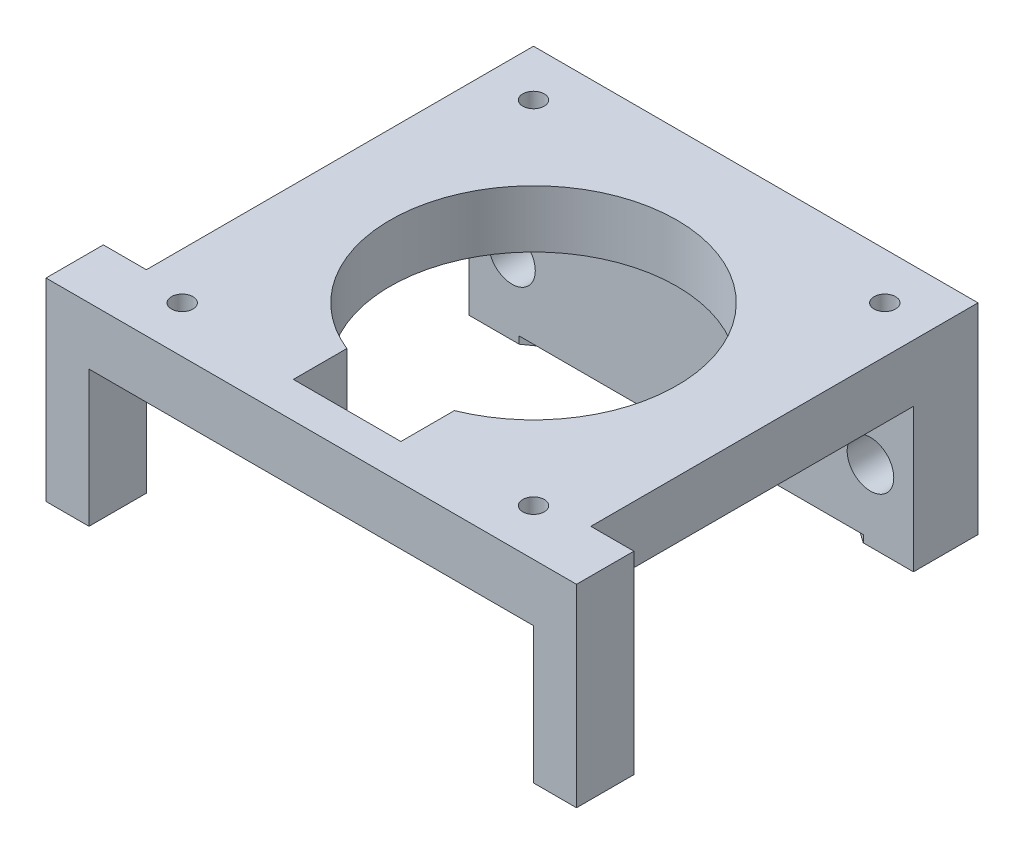
ISO-10303-21;
HEADER;
FILE_DESCRIPTION(('STEP AP214'),'2;1');
FILE_NAME('part.step','',(''),(''),'','','');
FILE_SCHEMA(('AUTOMOTIVE_DESIGN { 1 0 10303 214 1 1 1 1 }'));
ENDSEC;
DATA;
#1=APPLICATION_CONTEXT('core data for automotive mechanical design processes');
#2=APPLICATION_PROTOCOL_DEFINITION('international standard','automotive_design',2000,#1);
#3=PRODUCT_CONTEXT('',#1,'mechanical');
#4=PRODUCT('Part','Part','',(#3));
#5=PRODUCT_RELATED_PRODUCT_CATEGORY('part','',(#4));
#6=PRODUCT_DEFINITION_FORMATION('','',#4);
#7=PRODUCT_DEFINITION_CONTEXT('part definition',#1,'design');
#8=PRODUCT_DEFINITION('design','',#6,#7);
#9=PRODUCT_DEFINITION_SHAPE('','',#8);
#10=(LENGTH_UNIT() NAMED_UNIT(*) SI_UNIT(.MILLI.,.METRE.));
#11=(NAMED_UNIT(*) PLANE_ANGLE_UNIT() SI_UNIT($,.RADIAN.));
#12=(NAMED_UNIT(*) SI_UNIT($,.STERADIAN.) SOLID_ANGLE_UNIT());
#13=UNCERTAINTY_MEASURE_WITH_UNIT(LENGTH_MEASURE(1.E-05),#10,'distance_accuracy_value','');
#14=(GEOMETRIC_REPRESENTATION_CONTEXT(3) GLOBAL_UNCERTAINTY_ASSIGNED_CONTEXT((#13)) GLOBAL_UNIT_ASSIGNED_CONTEXT((#10,
#11,#12)) REPRESENTATION_CONTEXT('',''));
#15=CARTESIAN_POINT('',(0.,0.,0.));
#16=DIRECTION('',(0.,0.,1.));
#17=DIRECTION('',(1.,0.,0.));
#18=AXIS2_PLACEMENT_3D('',#15,#16,#17);
#19=CARTESIAN_POINT('',(15.5,4.,-15.5));
#20=DIRECTION('',(-1.,0.,0.));
#21=DIRECTION('',(0.,0.,1.));
#22=AXIS2_PLACEMENT_3D('',#19,#20,#21);
#23=PLANE('',#22);
#24=DIRECTION('',(0.,1.,0.));
#25=VECTOR('',#24,1.);
#26=CARTESIAN_POINT('',(15.5,-14.5,11.5));
#27=LINE('',#26,#25);
#28=CARTESIAN_POINT('',(15.5,0.,11.5));
#29=VERTEX_POINT('',#28);
#30=CARTESIAN_POINT('',(15.5,4.,11.5));
#31=VERTEX_POINT('',#30);
#32=EDGE_CURVE('E11',#29,#31,#27,.T.);
#33=ORIENTED_EDGE('',*,*,#32,.F.);
#34=DIRECTION('',(0.,0.,-1.));
#35=VECTOR('',#34,1.);
#36=CARTESIAN_POINT('',(15.5,0.,-15.5));
#37=LINE('',#36,#35);
#38=CARTESIAN_POINT('',(15.5,0.,-11.));
#39=VERTEX_POINT('',#38);
#40=EDGE_CURVE('E331',#29,#39,#37,.T.);
#41=ORIENTED_EDGE('',*,*,#40,.T.);
#42=DIRECTION('',(0.,1.,0.));
#43=VECTOR('',#42,1.);
#44=CARTESIAN_POINT('',(15.5,-10.,-11.));
#45=LINE('',#44,#43);
#46=CARTESIAN_POINT('',(15.5,-10.,-11.));
#47=VERTEX_POINT('',#46);
#48=EDGE_CURVE('E281',#47,#39,#45,.T.);
#49=ORIENTED_EDGE('',*,*,#48,.F.);
#50=DIRECTION('',(0.,0.,1.));
#51=VECTOR('',#50,1.);
#52=CARTESIAN_POINT('',(15.5,-10.,-15.5));
#53=LINE('',#52,#51);
#54=CARTESIAN_POINT('',(15.5,-10.,-15.5));
#55=VERTEX_POINT('',#54);
#56=EDGE_CURVE('E270',#55,#47,#53,.T.);
#57=ORIENTED_EDGE('',*,*,#56,.F.);
#58=DIRECTION('',(0.,-1.,0.));
#59=VECTOR('',#58,1.);
#60=CARTESIAN_POINT('',(15.5,4.,-15.5));
#61=LINE('',#60,#59);
#62=CARTESIAN_POINT('',(15.5,4.,-15.5));
#63=VERTEX_POINT('',#62);
#64=EDGE_CURVE('E335',#63,#55,#61,.T.);
#65=ORIENTED_EDGE('',*,*,#64,.F.);
#66=DIRECTION('',(0.,0.,-1.));
#67=VECTOR('',#66,1.);
#68=CARTESIAN_POINT('',(15.5,4.,-15.5));
#69=LINE('',#68,#67);
#70=EDGE_CURVE('E321',#31,#63,#69,.T.);
#71=ORIENTED_EDGE('',*,*,#70,.F.);
#72=EDGE_LOOP('',(#33,#41,#49,#57,#65,#71));
#73=FACE_BOUND('',#72,.T.);
#74=ADVANCED_FACE('F32',(#73),#23,.F.);
#75=CARTESIAN_POINT('',(0.,0.,0.));
#76=DIRECTION('',(0.,1.,0.));
#77=DIRECTION('',(0.,0.,1.));
#78=AXIS2_PLACEMENT_3D('',#75,#76,#77);
#79=PLANE('',#78);
#80=CARTESIAN_POINT('',(0.,0.,0.));
#81=DIRECTION('',(0.,1.,0.));
#82=DIRECTION('',(0.,0.,1.));
#83=AXIS2_PLACEMENT_3D('',#80,#81,#82);
#84=CIRCLE('',#83,10.);
#85=CARTESIAN_POINT('',(3.75,0.,9.27024810886958));
#86=VERTEX_POINT('',#85);
#87=CARTESIAN_POINT('',(-3.75,0.,9.27024810886958));
#88=VERTEX_POINT('',#87);
#89=EDGE_CURVE('E284',#86,#88,#84,.T.);
#90=ORIENTED_EDGE('',*,*,#89,.T.);
#91=DIRECTION('',(0.,0.,1.));
#92=VECTOR('',#91,1.);
#93=CARTESIAN_POINT('',(-3.75,0.,0.));
#94=LINE('',#93,#92);
#95=CARTESIAN_POINT('',(-3.75,0.,13.));
#96=VERTEX_POINT('',#95);
#97=EDGE_CURVE('E245',#88,#96,#94,.T.);
#98=ORIENTED_EDGE('',*,*,#97,.T.);
#99=DIRECTION('',(1.,0.,0.));
#100=VECTOR('',#99,1.);
#101=CARTESIAN_POINT('',(0.,0.,13.));
#102=LINE('',#101,#100);
#103=CARTESIAN_POINT('',(3.75,0.,13.));
#104=VERTEX_POINT('',#103);
#105=EDGE_CURVE('E248',#96,#104,#102,.T.);
#106=ORIENTED_EDGE('',*,*,#105,.T.);
#107=DIRECTION('',(0.,0.,-1.));
#108=VECTOR('',#107,1.);
#109=CARTESIAN_POINT('',(3.75,0.,0.));
#110=LINE('',#109,#108);
#111=EDGE_CURVE('E241',#104,#86,#110,.T.);
#112=ORIENTED_EDGE('',*,*,#111,.T.);
#113=EDGE_LOOP('',(#90,#98,#106,#112));
#114=FACE_BOUND('',#113,.T.);
#115=CARTESIAN_POINT('',(-12.25,0.,12.25));
#116=DIRECTION('',(0.,1.,0.));
#117=DIRECTION('',(0.,0.,1.));
#118=AXIS2_PLACEMENT_3D('',#115,#116,#117);
#119=CIRCLE('',#118,0.75);
#120=CARTESIAN_POINT('',(-12.25,0.,13.));
#121=VERTEX_POINT('',#120);
#122=EDGE_CURVE('E288',#121,#121,#119,.T.);
#123=ORIENTED_EDGE('',*,*,#122,.T.);
#124=EDGE_LOOP('',(#123));
#125=FACE_BOUND('',#124,.T.);
#126=CARTESIAN_POINT('',(12.25,0.,12.25));
#127=DIRECTION('',(0.,1.,0.));
#128=DIRECTION('',(0.,0.,1.));
#129=AXIS2_PLACEMENT_3D('',#126,#127,#128);
#130=CIRCLE('',#129,0.75);
#131=CARTESIAN_POINT('',(12.25,0.,13.));
#132=VERTEX_POINT('',#131);
#133=EDGE_CURVE('E294',#132,#132,#130,.T.);
#134=ORIENTED_EDGE('',*,*,#133,.T.);
#135=EDGE_LOOP('',(#134));
#136=FACE_BOUND('',#135,.T.);
#137=DIRECTION('',(-1.,0.,0.));
#138=VECTOR('',#137,1.);
#139=CARTESIAN_POINT('',(-15.5,0.,-11.));
#140=LINE('',#139,#138);
#141=CARTESIAN_POINT('',(-15.5,0.,-11.));
#142=VERTEX_POINT('',#141);
#143=EDGE_CURVE('E261',#39,#142,#140,.T.);
#144=ORIENTED_EDGE('',*,*,#143,.F.);
#145=ORIENTED_EDGE('',*,*,#40,.F.);
#146=CARTESIAN_POINT('',(15.5,0.,15.5));
#147=VERTEX_POINT('',#146);
#148=EDGE_CURVE('E319',#147,#29,#37,.T.);
#149=ORIENTED_EDGE('',*,*,#148,.F.);
#150=DIRECTION('',(1.,0.,0.));
#151=VECTOR('',#150,1.);
#152=CARTESIAN_POINT('',(-15.5,0.,15.5));
#153=LINE('',#152,#151);
#154=CARTESIAN_POINT('',(-15.5,0.,15.5));
#155=VERTEX_POINT('',#154);
#156=EDGE_CURVE('E329',#155,#147,#153,.T.);
#157=ORIENTED_EDGE('',*,*,#156,.F.);
#158=DIRECTION('',(0.,0.,1.));
#159=VECTOR('',#158,1.);
#160=CARTESIAN_POINT('',(-15.5,0.,-15.5));
#161=LINE('',#160,#159);
#162=CARTESIAN_POINT('',(-15.5,0.,11.5));
#163=VERTEX_POINT('',#162);
#164=EDGE_CURVE('E312',#163,#155,#161,.T.);
#165=ORIENTED_EDGE('',*,*,#164,.F.);
#166=EDGE_CURVE('E326',#142,#163,#161,.T.);
#167=ORIENTED_EDGE('',*,*,#166,.F.);
#168=EDGE_LOOP('',(#144,#145,#149,#157,#165,#167));
#169=FACE_BOUND('',#168,.T.);
#170=ADVANCED_FACE('F372',(#114,#125,#136,#169),#79,.F.);
#171=CARTESIAN_POINT('',(0.,4.,0.));
#172=DIRECTION('',(0.,1.,0.));
#173=DIRECTION('',(0.,0.,1.));
#174=AXIS2_PLACEMENT_3D('',#171,#172,#173);
#175=PLANE('',#174);
#176=DIRECTION('',(0.,0.,1.));
#177=VECTOR('',#176,1.);
#178=CARTESIAN_POINT('',(-3.75,4.,5.));
#179=LINE('',#178,#177);
#180=CARTESIAN_POINT('',(-3.75,4.,9.27024810886958));
#181=VERTEX_POINT('',#180);
#182=CARTESIAN_POINT('',(-3.75,4.,13.));
#183=VERTEX_POINT('',#182);
#184=EDGE_CURVE('E229',#181,#183,#179,.T.);
#185=ORIENTED_EDGE('',*,*,#184,.F.);
#186=CARTESIAN_POINT('',(0.,4.,0.));
#187=DIRECTION('',(0.,1.,0.));
#188=DIRECTION('',(0.,0.,1.));
#189=AXIS2_PLACEMENT_3D('',#186,#187,#188);
#190=CIRCLE('',#189,10.);
#191=CARTESIAN_POINT('',(3.75,4.,9.27024810886958));
#192=VERTEX_POINT('',#191);
#193=EDGE_CURVE('E285',#192,#181,#190,.T.);
#194=ORIENTED_EDGE('',*,*,#193,.F.);
#195=DIRECTION('',(0.,0.,-1.));
#196=VECTOR('',#195,1.);
#197=CARTESIAN_POINT('',(3.75,4.,5.));
#198=LINE('',#197,#196);
#199=CARTESIAN_POINT('',(3.75,4.,13.));
#200=VERTEX_POINT('',#199);
#201=EDGE_CURVE('E236',#200,#192,#198,.T.);
#202=ORIENTED_EDGE('',*,*,#201,.F.);
#203=DIRECTION('',(1.,0.,0.));
#204=VECTOR('',#203,1.);
#205=CARTESIAN_POINT('',(-3.75,4.,13.));
#206=LINE('',#205,#204);
#207=EDGE_CURVE('E233',#183,#200,#206,.T.);
#208=ORIENTED_EDGE('',*,*,#207,.F.);
#209=EDGE_LOOP('',(#185,#194,#202,#208));
#210=FACE_BOUND('',#209,.T.);
#211=CARTESIAN_POINT('',(-12.25,4.,12.25));
#212=DIRECTION('',(0.,1.,0.));
#213=DIRECTION('',(0.,0.,1.));
#214=AXIS2_PLACEMENT_3D('',#211,#212,#213);
#215=CIRCLE('',#214,0.75);
#216=CARTESIAN_POINT('',(-12.25,4.,13.));
#217=VERTEX_POINT('',#216);
#218=EDGE_CURVE('E291',#217,#217,#215,.T.);
#219=ORIENTED_EDGE('',*,*,#218,.F.);
#220=EDGE_LOOP('',(#219));
#221=FACE_BOUND('',#220,.T.);
#222=CARTESIAN_POINT('',(12.25,4.,-12.25));
#223=DIRECTION('',(0.,1.,0.));
#224=DIRECTION('',(0.,0.,1.));
#225=AXIS2_PLACEMENT_3D('',#222,#223,#224);
#226=CIRCLE('',#225,0.75);
#227=CARTESIAN_POINT('',(12.25,4.,-11.5));
#228=VERTEX_POINT('',#227);
#229=EDGE_CURVE('E303',#228,#228,#226,.T.);
#230=ORIENTED_EDGE('',*,*,#229,.F.);
#231=EDGE_LOOP('',(#230));
#232=FACE_BOUND('',#231,.T.);
#233=DIRECTION('',(0.,0.,1.));
#234=VECTOR('',#233,1.);
#235=CARTESIAN_POINT('',(-15.5,4.,-15.5));
#236=LINE('',#235,#234);
#237=CARTESIAN_POINT('',(-15.5,4.,-15.5));
#238=VERTEX_POINT('',#237);
#239=CARTESIAN_POINT('',(-15.5,4.,11.5));
#240=VERTEX_POINT('',#239);
#241=EDGE_CURVE('E315',#238,#240,#236,.T.);
#242=ORIENTED_EDGE('',*,*,#241,.T.);
#243=DIRECTION('',(-1.,0.,0.));
#244=VECTOR('',#243,1.);
#245=CARTESIAN_POINT('',(-15.5,4.,11.5));
#246=LINE('',#245,#244);
#247=CARTESIAN_POINT('',(-18.5,4.,11.5));
#248=VERTEX_POINT('',#247);
#249=EDGE_CURVE('E56',#240,#248,#246,.T.);
#250=ORIENTED_EDGE('',*,*,#249,.T.);
#251=DIRECTION('',(0.,0.,1.));
#252=VECTOR('',#251,1.);
#253=CARTESIAN_POINT('',(-18.5,4.,15.5));
#254=LINE('',#253,#252);
#255=CARTESIAN_POINT('',(-18.5,4.,15.5));
#256=VERTEX_POINT('',#255);
#257=EDGE_CURVE('E199',#248,#256,#254,.T.);
#258=ORIENTED_EDGE('',*,*,#257,.T.);
#259=DIRECTION('',(1.,0.,0.));
#260=VECTOR('',#259,1.);
#261=CARTESIAN_POINT('',(-15.5,4.,15.5));
#262=LINE('',#261,#260);
#263=CARTESIAN_POINT('',(18.5,4.,15.5));
#264=VERTEX_POINT('',#263);
#265=EDGE_CURVE('E318',#256,#264,#262,.T.);
#266=ORIENTED_EDGE('',*,*,#265,.T.);
#267=DIRECTION('',(0.,0.,-1.));
#268=VECTOR('',#267,1.);
#269=CARTESIAN_POINT('',(18.5,4.,15.5));
#270=LINE('',#269,#268);
#271=CARTESIAN_POINT('',(18.5,4.,11.5));
#272=VERTEX_POINT('',#271);
#273=EDGE_CURVE('E180',#264,#272,#270,.T.);
#274=ORIENTED_EDGE('',*,*,#273,.T.);
#275=DIRECTION('',(-1.,0.,0.));
#276=VECTOR('',#275,1.);
#277=CARTESIAN_POINT('',(15.5,4.,11.5));
#278=LINE('',#277,#276);
#279=EDGE_CURVE('E187',#272,#31,#278,.T.);
#280=ORIENTED_EDGE('',*,*,#279,.T.);
#281=ORIENTED_EDGE('',*,*,#70,.T.);
#282=DIRECTION('',(-1.,0.,0.));
#283=VECTOR('',#282,1.);
#284=CARTESIAN_POINT('',(-15.5,4.,-15.5));
#285=LINE('',#284,#283);
#286=EDGE_CURVE('E323',#63,#238,#285,.T.);
#287=ORIENTED_EDGE('',*,*,#286,.T.);
#288=EDGE_LOOP('',(#242,#250,#258,#266,#274,#280,#281,#287));
#289=FACE_BOUND('',#288,.T.);
#290=CARTESIAN_POINT('',(-12.25,4.,-12.25));
#291=DIRECTION('',(0.,1.,0.));
#292=DIRECTION('',(0.,0.,1.));
#293=AXIS2_PLACEMENT_3D('',#290,#291,#292);
#294=CIRCLE('',#293,0.75);
#295=CARTESIAN_POINT('',(-12.25,4.,-11.5));
#296=VERTEX_POINT('',#295);
#297=EDGE_CURVE('E309',#296,#296,#294,.T.);
#298=ORIENTED_EDGE('',*,*,#297,.F.);
#299=EDGE_LOOP('',(#298));
#300=FACE_BOUND('',#299,.T.);
#301=CARTESIAN_POINT('',(12.25,4.,12.25));
#302=DIRECTION('',(0.,1.,0.));
#303=DIRECTION('',(0.,0.,1.));
#304=AXIS2_PLACEMENT_3D('',#301,#302,#303);
#305=CIRCLE('',#304,0.75);
#306=CARTESIAN_POINT('',(12.25,4.,13.));
#307=VERTEX_POINT('',#306);
#308=EDGE_CURVE('E297',#307,#307,#305,.T.);
#309=ORIENTED_EDGE('',*,*,#308,.F.);
#310=EDGE_LOOP('',(#309));
#311=FACE_BOUND('',#310,.T.);
#312=ADVANCED_FACE('F354',(#210,#221,#232,#289,#300,#311),#175,.T.);
#313=CARTESIAN_POINT('',(-15.5,4.,-15.5));
#314=DIRECTION('',(1.,0.,0.));
#315=DIRECTION('',(0.,0.,-1.));
#316=AXIS2_PLACEMENT_3D('',#313,#314,#315);
#317=PLANE('',#316);
#318=ORIENTED_EDGE('',*,*,#166,.T.);
#319=DIRECTION('',(0.,1.,0.));
#320=VECTOR('',#319,1.);
#321=CARTESIAN_POINT('',(-15.5,-14.5,11.5));
#322=LINE('',#321,#320);
#323=EDGE_CURVE('E41',#163,#240,#322,.T.);
#324=ORIENTED_EDGE('',*,*,#323,.T.);
#325=ORIENTED_EDGE('',*,*,#241,.F.);
#326=DIRECTION('',(0.,-1.,0.));
#327=VECTOR('',#326,1.);
#328=CARTESIAN_POINT('',(-15.5,4.,-15.5));
#329=LINE('',#328,#327);
#330=CARTESIAN_POINT('',(-15.5,-10.,-15.5));
#331=VERTEX_POINT('',#330);
#332=EDGE_CURVE('E325',#238,#331,#329,.T.);
#333=ORIENTED_EDGE('',*,*,#332,.T.);
#334=DIRECTION('',(0.,0.,-1.));
#335=VECTOR('',#334,1.);
#336=CARTESIAN_POINT('',(-15.5,-10.,-15.5));
#337=LINE('',#336,#335);
#338=CARTESIAN_POINT('',(-15.5,-10.,-11.));
#339=VERTEX_POINT('',#338);
#340=EDGE_CURVE('E264',#339,#331,#337,.T.);
#341=ORIENTED_EDGE('',*,*,#340,.F.);
#342=DIRECTION('',(0.,1.,0.));
#343=VECTOR('',#342,1.);
#344=CARTESIAN_POINT('',(-15.5,-10.,-11.));
#345=LINE('',#344,#343);
#346=EDGE_CURVE('E276',#339,#142,#345,.T.);
#347=ORIENTED_EDGE('',*,*,#346,.T.);
#348=EDGE_LOOP('',(#318,#324,#325,#333,#341,#347));
#349=FACE_BOUND('',#348,.T.);
#350=ADVANCED_FACE('F34',(#349),#317,.F.);
#351=CARTESIAN_POINT('',(-15.5,4.,15.5));
#352=DIRECTION('',(0.,0.,-1.));
#353=DIRECTION('',(-1.,0.,0.));
#354=AXIS2_PLACEMENT_3D('',#351,#352,#353);
#355=PLANE('',#354);
#356=ORIENTED_EDGE('',*,*,#156,.T.);
#357=DIRECTION('',(0.,1.,0.));
#358=VECTOR('',#357,1.);
#359=CARTESIAN_POINT('',(15.5,-14.5,15.5));
#360=LINE('',#359,#358);
#361=CARTESIAN_POINT('',(15.5,-9.5,15.5));
#362=VERTEX_POINT('',#361);
#363=EDGE_CURVE('E186',#362,#147,#360,.T.);
#364=ORIENTED_EDGE('',*,*,#363,.F.);
#365=DIRECTION('',(1.,0.,0.));
#366=VECTOR('',#365,1.);
#367=CARTESIAN_POINT('',(15.5,-9.5,15.5));
#368=LINE('',#367,#366);
#369=CARTESIAN_POINT('',(18.5,-9.5,15.5));
#370=VERTEX_POINT('',#369);
#371=EDGE_CURVE('E167',#362,#370,#368,.T.);
#372=ORIENTED_EDGE('',*,*,#371,.T.);
#373=DIRECTION('',(0.,1.,0.));
#374=VECTOR('',#373,1.);
#375=CARTESIAN_POINT('',(18.5,-14.5,15.5));
#376=LINE('',#375,#374);
#377=EDGE_CURVE('E174',#370,#264,#376,.T.);
#378=ORIENTED_EDGE('',*,*,#377,.T.);
#379=ORIENTED_EDGE('',*,*,#265,.F.);
#380=DIRECTION('',(0.,1.,0.));
#381=VECTOR('',#380,1.);
#382=CARTESIAN_POINT('',(-18.5,-14.5,15.5));
#383=LINE('',#382,#381);
#384=CARTESIAN_POINT('',(-18.5,-9.5,15.5));
#385=VERTEX_POINT('',#384);
#386=EDGE_CURVE('E215',#385,#256,#383,.T.);
#387=ORIENTED_EDGE('',*,*,#386,.F.);
#388=DIRECTION('',(1.,0.,0.));
#389=VECTOR('',#388,1.);
#390=CARTESIAN_POINT('',(-15.5,-9.5,15.5));
#391=LINE('',#390,#389);
#392=CARTESIAN_POINT('',(-15.5,-9.5,15.5));
#393=VERTEX_POINT('',#392);
#394=EDGE_CURVE('E212',#385,#393,#391,.T.);
#395=ORIENTED_EDGE('',*,*,#394,.T.);
#396=DIRECTION('',(0.,1.,0.));
#397=VECTOR('',#396,1.);
#398=CARTESIAN_POINT('',(-15.5,-14.5,15.5));
#399=LINE('',#398,#397);
#400=EDGE_CURVE('E211',#393,#155,#399,.T.);
#401=ORIENTED_EDGE('',*,*,#400,.T.);
#402=EDGE_LOOP('',(#356,#364,#372,#378,#379,#387,#395,#401));
#403=FACE_BOUND('',#402,.T.);
#404=ADVANCED_FACE('F184',(#403),#355,.F.);
#405=CARTESIAN_POINT('',(-15.5,4.,-15.5));
#406=DIRECTION('',(0.,0.,1.));
#407=DIRECTION('',(1.,0.,0.));
#408=AXIS2_PLACEMENT_3D('',#405,#406,#407);
#409=PLANE('',#408);
#410=CARTESIAN_POINT('',(12.5,-5.,-15.5));
#411=DIRECTION('',(0.,0.,1.));
#412=DIRECTION('',(1.,0.,0.));
#413=AXIS2_PLACEMENT_3D('',#410,#411,#412);
#414=CIRCLE('',#413,1.625);
#415=CARTESIAN_POINT('',(14.125,-5.,-15.5));
#416=VERTEX_POINT('',#415);
#417=EDGE_CURVE('E252',#416,#416,#414,.T.);
#418=ORIENTED_EDGE('',*,*,#417,.T.);
#419=EDGE_LOOP('',(#418));
#420=FACE_BOUND('',#419,.T.);
#421=CARTESIAN_POINT('',(-12.5,-5.,-15.5));
#422=DIRECTION('',(0.,0.,1.));
#423=DIRECTION('',(1.,0.,0.));
#424=AXIS2_PLACEMENT_3D('',#421,#422,#423);
#425=CIRCLE('',#424,1.625);
#426=CARTESIAN_POINT('',(-10.875,-5.,-15.5));
#427=VERTEX_POINT('',#426);
#428=EDGE_CURVE('E258',#427,#427,#425,.T.);
#429=ORIENTED_EDGE('',*,*,#428,.T.);
#430=EDGE_LOOP('',(#429));
#431=FACE_BOUND('',#430,.T.);
#432=ORIENTED_EDGE('',*,*,#64,.T.);
#433=DIRECTION('',(1.,0.,0.));
#434=VECTOR('',#433,1.);
#435=CARTESIAN_POINT('',(-15.5,-10.,-15.5));
#436=LINE('',#435,#434);
#437=EDGE_CURVE('E267',#331,#55,#436,.T.);
#438=ORIENTED_EDGE('',*,*,#437,.F.);
#439=ORIENTED_EDGE('',*,*,#332,.F.);
#440=ORIENTED_EDGE('',*,*,#286,.F.);
#441=EDGE_LOOP('',(#432,#438,#439,#440));
#442=FACE_BOUND('',#441,.T.);
#443=ADVANCED_FACE('F361',(#420,#431,#442),#409,.F.);
#444=CARTESIAN_POINT('',(-12.25,4.,-12.25));
#445=DIRECTION('',(0.,-1.,0.));
#446=DIRECTION('',(0.,0.,-1.));
#447=AXIS2_PLACEMENT_3D('',#444,#445,#446);
#448=CYLINDRICAL_SURFACE('',#447,0.75);
#449=ORIENTED_EDGE('',*,*,#297,.T.);
#450=EDGE_LOOP('',(#449));
#451=FACE_BOUND('',#450,.T.);
#452=CARTESIAN_POINT('',(-12.25,0.,-12.25));
#453=DIRECTION('',(0.,1.,0.));
#454=DIRECTION('',(0.,0.,1.));
#455=AXIS2_PLACEMENT_3D('',#452,#453,#454);
#456=CIRCLE('',#455,0.75);
#457=CARTESIAN_POINT('',(-12.25,0.,-11.5));
#458=VERTEX_POINT('',#457);
#459=EDGE_CURVE('E306',#458,#458,#456,.T.);
#460=ORIENTED_EDGE('',*,*,#459,.F.);
#461=EDGE_LOOP('',(#460));
#462=FACE_BOUND('',#461,.T.);
#463=ADVANCED_FACE('F414',(#451,#462),#448,.F.);
#464=CARTESIAN_POINT('',(12.25,4.,-12.25));
#465=DIRECTION('',(0.,-1.,0.));
#466=DIRECTION('',(0.,0.,-1.));
#467=AXIS2_PLACEMENT_3D('',#464,#465,#466);
#468=CYLINDRICAL_SURFACE('',#467,0.75);
#469=ORIENTED_EDGE('',*,*,#229,.T.);
#470=EDGE_LOOP('',(#469));
#471=FACE_BOUND('',#470,.T.);
#472=CARTESIAN_POINT('',(12.25,0.,-12.25));
#473=DIRECTION('',(0.,1.,0.));
#474=DIRECTION('',(0.,0.,1.));
#475=AXIS2_PLACEMENT_3D('',#472,#473,#474);
#476=CIRCLE('',#475,0.75);
#477=CARTESIAN_POINT('',(12.25,0.,-11.5));
#478=VERTEX_POINT('',#477);
#479=EDGE_CURVE('E300',#478,#478,#476,.T.);
#480=ORIENTED_EDGE('',*,*,#479,.F.);
#481=EDGE_LOOP('',(#480));
#482=FACE_BOUND('',#481,.T.);
#483=ADVANCED_FACE('F429',(#471,#482),#468,.F.);
#484=CARTESIAN_POINT('',(12.25,4.,12.25));
#485=DIRECTION('',(0.,-1.,0.));
#486=DIRECTION('',(0.,0.,-1.));
#487=AXIS2_PLACEMENT_3D('',#484,#485,#486);
#488=CYLINDRICAL_SURFACE('',#487,0.75);
#489=ORIENTED_EDGE('',*,*,#308,.T.);
#490=EDGE_LOOP('',(#489));
#491=FACE_BOUND('',#490,.T.);
#492=ORIENTED_EDGE('',*,*,#133,.F.);
#493=EDGE_LOOP('',(#492));
#494=FACE_BOUND('',#493,.T.);
#495=ADVANCED_FACE('F433',(#491,#494),#488,.F.);
#496=CARTESIAN_POINT('',(-12.25,4.,12.25));
#497=DIRECTION('',(0.,-1.,0.));
#498=DIRECTION('',(0.,0.,-1.));
#499=AXIS2_PLACEMENT_3D('',#496,#497,#498);
#500=CYLINDRICAL_SURFACE('',#499,0.75);
#501=ORIENTED_EDGE('',*,*,#218,.T.);
#502=EDGE_LOOP('',(#501));
#503=FACE_BOUND('',#502,.T.);
#504=ORIENTED_EDGE('',*,*,#122,.F.);
#505=EDGE_LOOP('',(#504));
#506=FACE_BOUND('',#505,.T.);
#507=ADVANCED_FACE('F437',(#503,#506),#500,.F.);
#508=CARTESIAN_POINT('',(0.,4.,0.));
#509=DIRECTION('',(0.,-1.,0.));
#510=DIRECTION('',(0.,0.,-1.));
#511=AXIS2_PLACEMENT_3D('',#508,#509,#510);
#512=CYLINDRICAL_SURFACE('',#511,10.);
#513=DIRECTION('',(0.,-1.,0.));
#514=VECTOR('',#513,1.);
#515=CARTESIAN_POINT('',(-3.75,4.,9.27024810886958));
#516=LINE('',#515,#514);
#517=EDGE_CURVE('E339',#88,#181,#516,.F.);
#518=ORIENTED_EDGE('',*,*,#517,.F.);
#519=ORIENTED_EDGE('',*,*,#89,.F.);
#520=DIRECTION('',(0.,-1.,0.));
#521=VECTOR('',#520,1.);
#522=CARTESIAN_POINT('',(3.75,4.,9.27024810886958));
#523=LINE('',#522,#521);
#524=EDGE_CURVE('E337',#192,#86,#523,.T.);
#525=ORIENTED_EDGE('',*,*,#524,.F.);
#526=ORIENTED_EDGE('',*,*,#193,.T.);
#527=EDGE_LOOP('',(#518,#519,#525,#526));
#528=FACE_BOUND('',#527,.T.);
#529=ADVANCED_FACE('F441',(#528),#512,.F.);
#530=CARTESIAN_POINT('',(0.,-10.,0.));
#531=DIRECTION('',(0.,1.,0.));
#532=DIRECTION('',(0.,0.,1.));
#533=AXIS2_PLACEMENT_3D('',#530,#531,#532);
#534=PLANE('',#533);
#535=DIRECTION('',(-1.,0.,0.));
#536=VECTOR('',#535,1.);
#537=CARTESIAN_POINT('',(-15.5,-10.,-11.));
#538=LINE('',#537,#536);
#539=CARTESIAN_POINT('',(12.,-10.,-11.));
#540=VERTEX_POINT('',#539);
#541=EDGE_CURVE('E273',#47,#540,#538,.T.);
#542=ORIENTED_EDGE('',*,*,#541,.T.);
#543=CARTESIAN_POINT('',(0.,-10.,5.));
#544=DIRECTION('',(0.,-1.,0.));
#545=DIRECTION('',(0.,0.,-1.));
#546=AXIS2_PLACEMENT_3D('',#543,#544,#545);
#547=CIRCLE('',#546,20.);
#548=CARTESIAN_POINT('',(-12.,-10.,-11.));
#549=VERTEX_POINT('',#548);
#550=EDGE_CURVE('E226',#549,#540,#547,.T.);
#551=ORIENTED_EDGE('',*,*,#550,.F.);
#552=EDGE_CURVE('E272',#549,#339,#538,.T.);
#553=ORIENTED_EDGE('',*,*,#552,.T.);
#554=ORIENTED_EDGE('',*,*,#340,.T.);
#555=ORIENTED_EDGE('',*,*,#437,.T.);
#556=ORIENTED_EDGE('',*,*,#56,.T.);
#557=EDGE_LOOP('',(#542,#551,#553,#554,#555,#556));
#558=FACE_BOUND('',#557,.T.);
#559=ADVANCED_FACE('F365',(#558),#534,.F.);
#560=CARTESIAN_POINT('',(-15.5,-10.,-11.));
#561=DIRECTION('',(0.,0.,-1.));
#562=DIRECTION('',(-1.,0.,0.));
#563=AXIS2_PLACEMENT_3D('',#560,#561,#562);
#564=PLANE('',#563);
#565=CARTESIAN_POINT('',(12.5,-5.,-11.));
#566=DIRECTION('',(0.,0.,1.));
#567=DIRECTION('',(1.,0.,0.));
#568=AXIS2_PLACEMENT_3D('',#565,#566,#567);
#569=CIRCLE('',#568,1.625);
#570=CARTESIAN_POINT('',(14.125,-5.,-11.));
#571=VERTEX_POINT('',#570);
#572=EDGE_CURVE('E251',#571,#571,#569,.T.);
#573=ORIENTED_EDGE('',*,*,#572,.F.);
#574=EDGE_LOOP('',(#573));
#575=FACE_BOUND('',#574,.T.);
#576=CARTESIAN_POINT('',(-12.5,-5.,-11.));
#577=DIRECTION('',(0.,0.,1.));
#578=DIRECTION('',(1.,0.,0.));
#579=AXIS2_PLACEMENT_3D('',#576,#577,#578);
#580=CIRCLE('',#579,1.625);
#581=CARTESIAN_POINT('',(-10.875,-5.,-11.));
#582=VERTEX_POINT('',#581);
#583=EDGE_CURVE('E255',#582,#582,#580,.T.);
#584=ORIENTED_EDGE('',*,*,#583,.F.);
#585=EDGE_LOOP('',(#584));
#586=FACE_BOUND('',#585,.T.);
#587=DIRECTION('',(-1.,0.,0.));
#588=VECTOR('',#587,1.);
#589=CARTESIAN_POINT('',(-15.5,-9.5,-11.));
#590=LINE('',#589,#588);
#591=CARTESIAN_POINT('',(12.,-9.5,-11.));
#592=VERTEX_POINT('',#591);
#593=CARTESIAN_POINT('',(-12.,-9.5,-11.));
#594=VERTEX_POINT('',#593);
#595=EDGE_CURVE('E341',#592,#594,#590,.T.);
#596=ORIENTED_EDGE('',*,*,#595,.F.);
#597=DIRECTION('',(0.,-1.,0.));
#598=VECTOR('',#597,1.);
#599=CARTESIAN_POINT('',(12.,-9.5,-11.));
#600=LINE('',#599,#598);
#601=EDGE_CURVE('E36',#592,#540,#600,.T.);
#602=ORIENTED_EDGE('',*,*,#601,.T.);
#603=ORIENTED_EDGE('',*,*,#541,.F.);
#604=ORIENTED_EDGE('',*,*,#48,.T.);
#605=ORIENTED_EDGE('',*,*,#143,.T.);
#606=ORIENTED_EDGE('',*,*,#346,.F.);
#607=ORIENTED_EDGE('',*,*,#552,.F.);
#608=DIRECTION('',(0.,-1.,0.));
#609=VECTOR('',#608,1.);
#610=CARTESIAN_POINT('',(-12.,-9.5,-11.));
#611=LINE('',#610,#609);
#612=EDGE_CURVE('E342',#549,#594,#611,.F.);
#613=ORIENTED_EDGE('',*,*,#612,.T.);
#614=EDGE_LOOP('',(#596,#602,#603,#604,#605,#606,#607,#613));
#615=FACE_BOUND('',#614,.T.);
#616=ADVANCED_FACE('F368',(#575,#586,#615),#564,.F.);
#617=CARTESIAN_POINT('',(0.,0.,0.));
#618=DIRECTION('',(0.,1.,0.));
#619=DIRECTION('',(0.,0.,1.));
#620=AXIS2_PLACEMENT_3D('',#617,#618,#619);
#621=PLANE('',#620);
#622=ORIENTED_EDGE('',*,*,#479,.T.);
#623=EDGE_LOOP('',(#622));
#624=FACE_BOUND('',#623,.T.);
#625=ADVANCED_FACE('F448',(#624),#621,.T.);
#626=ORIENTED_EDGE('',*,*,#459,.T.);
#627=EDGE_LOOP('',(#626));
#628=FACE_BOUND('',#627,.T.);
#629=ADVANCED_FACE('F452',(#628),#621,.T.);
#630=CARTESIAN_POINT('',(-12.5,-5.,-15.5));
#631=DIRECTION('',(0.,0.,1.));
#632=DIRECTION('',(1.,0.,0.));
#633=AXIS2_PLACEMENT_3D('',#630,#631,#632);
#634=CYLINDRICAL_SURFACE('',#633,1.625);
#635=ORIENTED_EDGE('',*,*,#428,.F.);
#636=EDGE_LOOP('',(#635));
#637=FACE_BOUND('',#636,.T.);
#638=ORIENTED_EDGE('',*,*,#583,.T.);
#639=EDGE_LOOP('',(#638));
#640=FACE_BOUND('',#639,.T.);
#641=ADVANCED_FACE('F456',(#637,#640),#634,.F.);
#642=CARTESIAN_POINT('',(12.5,-5.,-15.5));
#643=DIRECTION('',(0.,0.,1.));
#644=DIRECTION('',(1.,0.,0.));
#645=AXIS2_PLACEMENT_3D('',#642,#643,#644);
#646=CYLINDRICAL_SURFACE('',#645,1.625);
#647=ORIENTED_EDGE('',*,*,#417,.F.);
#648=EDGE_LOOP('',(#647));
#649=FACE_BOUND('',#648,.T.);
#650=ORIENTED_EDGE('',*,*,#572,.T.);
#651=EDGE_LOOP('',(#650));
#652=FACE_BOUND('',#651,.T.);
#653=ADVANCED_FACE('F459',(#649,#652),#646,.F.);
#654=CARTESIAN_POINT('',(-3.75,-10.,13.));
#655=DIRECTION('',(0.,0.,1.));
#656=DIRECTION('',(1.,0.,0.));
#657=AXIS2_PLACEMENT_3D('',#654,#655,#656);
#658=PLANE('',#657);
#659=DIRECTION('',(0.,1.,0.));
#660=VECTOR('',#659,1.);
#661=CARTESIAN_POINT('',(-3.75,-10.,13.));
#662=LINE('',#661,#660);
#663=EDGE_CURVE('E238',#96,#183,#662,.T.);
#664=ORIENTED_EDGE('',*,*,#663,.T.);
#665=ORIENTED_EDGE('',*,*,#207,.T.);
#666=DIRECTION('',(0.,1.,0.));
#667=VECTOR('',#666,1.);
#668=CARTESIAN_POINT('',(3.75,-10.,13.));
#669=LINE('',#668,#667);
#670=EDGE_CURVE('E239',#104,#200,#669,.T.);
#671=ORIENTED_EDGE('',*,*,#670,.F.);
#672=ORIENTED_EDGE('',*,*,#105,.F.);
#673=EDGE_LOOP('',(#664,#665,#671,#672));
#674=FACE_BOUND('',#673,.T.);
#675=ADVANCED_FACE('F463',(#674),#658,.F.);
#676=CARTESIAN_POINT('',(-3.75,-10.,5.));
#677=DIRECTION('',(-1.,0.,0.));
#678=DIRECTION('',(0.,0.,1.));
#679=AXIS2_PLACEMENT_3D('',#676,#677,#678);
#680=PLANE('',#679);
#681=ORIENTED_EDGE('',*,*,#517,.T.);
#682=ORIENTED_EDGE('',*,*,#184,.T.);
#683=ORIENTED_EDGE('',*,*,#663,.F.);
#684=ORIENTED_EDGE('',*,*,#97,.F.);
#685=EDGE_LOOP('',(#681,#682,#683,#684));
#686=FACE_BOUND('',#685,.T.);
#687=ADVANCED_FACE('F465',(#686),#680,.F.);
#688=CARTESIAN_POINT('',(3.75,-10.,5.));
#689=DIRECTION('',(1.,0.,0.));
#690=DIRECTION('',(0.,0.,-1.));
#691=AXIS2_PLACEMENT_3D('',#688,#689,#690);
#692=PLANE('',#691);
#693=ORIENTED_EDGE('',*,*,#670,.T.);
#694=ORIENTED_EDGE('',*,*,#201,.T.);
#695=ORIENTED_EDGE('',*,*,#524,.T.);
#696=ORIENTED_EDGE('',*,*,#111,.F.);
#697=EDGE_LOOP('',(#693,#694,#695,#696));
#698=FACE_BOUND('',#697,.T.);
#699=ADVANCED_FACE('F468',(#698),#692,.F.);
#700=CARTESIAN_POINT('',(0.,-9.5,5.));
#701=DIRECTION('',(0.,-1.,0.));
#702=DIRECTION('',(0.,0.,-1.));
#703=AXIS2_PLACEMENT_3D('',#700,#701,#702);
#704=CYLINDRICAL_SURFACE('',#703,20.);
#705=CARTESIAN_POINT('',(0.,-9.5,5.));
#706=DIRECTION('',(0.,-1.,0.));
#707=DIRECTION('',(0.,0.,-1.));
#708=AXIS2_PLACEMENT_3D('',#705,#706,#707);
#709=CIRCLE('',#708,20.);
#710=EDGE_CURVE('E227',#594,#592,#709,.T.);
#711=ORIENTED_EDGE('',*,*,#710,.F.);
#712=ORIENTED_EDGE('',*,*,#612,.F.);
#713=ORIENTED_EDGE('',*,*,#550,.T.);
#714=ORIENTED_EDGE('',*,*,#601,.F.);
#715=EDGE_LOOP('',(#711,#712,#713,#714));
#716=FACE_BOUND('',#715,.T.);
#717=ADVANCED_FACE('F475',(#716),#704,.F.);
#718=CARTESIAN_POINT('',(0.,-9.5,5.));
#719=DIRECTION('',(0.,-1.,0.));
#720=DIRECTION('',(0.,0.,-1.));
#721=AXIS2_PLACEMENT_3D('',#718,#719,#720);
#722=PLANE('',#721);
#723=ORIENTED_EDGE('',*,*,#595,.T.);
#724=ORIENTED_EDGE('',*,*,#710,.T.);
#725=EDGE_LOOP('',(#723,#724));
#726=FACE_BOUND('',#725,.T.);
#727=ADVANCED_FACE('F478',(#726),#722,.T.);
#728=CARTESIAN_POINT('',(0.,-9.5,5.));
#729=DIRECTION('',(0.,-1.,0.));
#730=DIRECTION('',(0.,0.,-1.));
#731=AXIS2_PLACEMENT_3D('',#728,#729,#730);
#732=PLANE('',#731);
#733=DIRECTION('',(0.,0.,-1.));
#734=VECTOR('',#733,1.);
#735=CARTESIAN_POINT('',(-15.5,-9.5,15.5));
#736=LINE('',#735,#734);
#737=CARTESIAN_POINT('',(-15.5,-9.5,11.5));
#738=VERTEX_POINT('',#737);
#739=EDGE_CURVE('E207',#393,#738,#736,.T.);
#740=ORIENTED_EDGE('',*,*,#739,.F.);
#741=ORIENTED_EDGE('',*,*,#394,.F.);
#742=DIRECTION('',(0.,0.,1.));
#743=VECTOR('',#742,1.);
#744=CARTESIAN_POINT('',(-18.5,-9.5,15.5));
#745=LINE('',#744,#743);
#746=CARTESIAN_POINT('',(-18.5,-9.5,11.5));
#747=VERTEX_POINT('',#746);
#748=EDGE_CURVE('E216',#747,#385,#745,.T.);
#749=ORIENTED_EDGE('',*,*,#748,.F.);
#750=DIRECTION('',(-1.,0.,0.));
#751=VECTOR('',#750,1.);
#752=CARTESIAN_POINT('',(-15.5,-9.5,11.5));
#753=LINE('',#752,#751);
#754=EDGE_CURVE('E202',#738,#747,#753,.T.);
#755=ORIENTED_EDGE('',*,*,#754,.F.);
#756=EDGE_LOOP('',(#740,#741,#749,#755));
#757=FACE_BOUND('',#756,.T.);
#758=ADVANCED_FACE('F381',(#757),#732,.T.);
#759=CARTESIAN_POINT('',(-15.5,-14.5,11.5));
#760=DIRECTION('',(0.,0.,-1.));
#761=DIRECTION('',(-1.,0.,0.));
#762=AXIS2_PLACEMENT_3D('',#759,#760,#761);
#763=PLANE('',#762);
#764=EDGE_CURVE('E210',#738,#163,#322,.T.);
#765=ORIENTED_EDGE('',*,*,#764,.F.);
#766=ORIENTED_EDGE('',*,*,#754,.T.);
#767=DIRECTION('',(0.,1.,0.));
#768=VECTOR('',#767,1.);
#769=CARTESIAN_POINT('',(-18.5,-14.5,11.5));
#770=LINE('',#769,#768);
#771=EDGE_CURVE('E206',#747,#248,#770,.T.);
#772=ORIENTED_EDGE('',*,*,#771,.T.);
#773=ORIENTED_EDGE('',*,*,#249,.F.);
#774=ORIENTED_EDGE('',*,*,#323,.F.);
#775=EDGE_LOOP('',(#765,#766,#772,#773,#774));
#776=FACE_BOUND('',#775,.T.);
#777=ADVANCED_FACE('F383',(#776),#763,.T.);
#778=CARTESIAN_POINT('',(-18.5,-14.5,15.5));
#779=DIRECTION('',(-1.,0.,0.));
#780=DIRECTION('',(0.,0.,1.));
#781=AXIS2_PLACEMENT_3D('',#778,#779,#780);
#782=PLANE('',#781);
#783=ORIENTED_EDGE('',*,*,#771,.F.);
#784=ORIENTED_EDGE('',*,*,#748,.T.);
#785=ORIENTED_EDGE('',*,*,#386,.T.);
#786=ORIENTED_EDGE('',*,*,#257,.F.);
#787=EDGE_LOOP('',(#783,#784,#785,#786));
#788=FACE_BOUND('',#787,.T.);
#789=ADVANCED_FACE('F386',(#788),#782,.T.);
#790=CARTESIAN_POINT('',(-15.5,-14.5,15.5));
#791=DIRECTION('',(1.,0.,0.));
#792=DIRECTION('',(0.,0.,-1.));
#793=AXIS2_PLACEMENT_3D('',#790,#791,#792);
#794=PLANE('',#793);
#795=ORIENTED_EDGE('',*,*,#764,.T.);
#796=ORIENTED_EDGE('',*,*,#164,.T.);
#797=ORIENTED_EDGE('',*,*,#400,.F.);
#798=ORIENTED_EDGE('',*,*,#739,.T.);
#799=EDGE_LOOP('',(#795,#796,#797,#798));
#800=FACE_BOUND('',#799,.T.);
#801=ADVANCED_FACE('F378',(#800),#794,.T.);
#802=CARTESIAN_POINT('',(0.,-9.5,5.));
#803=DIRECTION('',(0.,-1.,0.));
#804=DIRECTION('',(0.,0.,-1.));
#805=AXIS2_PLACEMENT_3D('',#802,#803,#804);
#806=PLANE('',#805);
#807=DIRECTION('',(0.,0.,1.));
#808=VECTOR('',#807,1.);
#809=CARTESIAN_POINT('',(15.5,-9.5,15.5));
#810=LINE('',#809,#808);
#811=CARTESIAN_POINT('',(15.5,-9.5,11.5));
#812=VERTEX_POINT('',#811);
#813=EDGE_CURVE('E193',#812,#362,#810,.T.);
#814=ORIENTED_EDGE('',*,*,#813,.F.);
#815=DIRECTION('',(-1.,0.,0.));
#816=VECTOR('',#815,1.);
#817=CARTESIAN_POINT('',(15.5,-9.5,11.5));
#818=LINE('',#817,#816);
#819=CARTESIAN_POINT('',(18.5,-9.5,11.5));
#820=VERTEX_POINT('',#819);
#821=EDGE_CURVE('E170',#820,#812,#818,.T.);
#822=ORIENTED_EDGE('',*,*,#821,.F.);
#823=DIRECTION('',(0.,0.,-1.));
#824=VECTOR('',#823,1.);
#825=CARTESIAN_POINT('',(18.5,-9.5,15.5));
#826=LINE('',#825,#824);
#827=EDGE_CURVE('E163',#370,#820,#826,.T.);
#828=ORIENTED_EDGE('',*,*,#827,.F.);
#829=ORIENTED_EDGE('',*,*,#371,.F.);
#830=EDGE_LOOP('',(#814,#822,#828,#829));
#831=FACE_BOUND('',#830,.T.);
#832=ADVANCED_FACE('F165',(#831),#806,.T.);
#833=CARTESIAN_POINT('',(18.5,-14.5,15.5));
#834=DIRECTION('',(1.,0.,0.));
#835=DIRECTION('',(0.,0.,-1.));
#836=AXIS2_PLACEMENT_3D('',#833,#834,#835);
#837=PLANE('',#836);
#838=ORIENTED_EDGE('',*,*,#377,.F.);
#839=ORIENTED_EDGE('',*,*,#827,.T.);
#840=DIRECTION('',(0.,1.,0.));
#841=VECTOR('',#840,1.);
#842=CARTESIAN_POINT('',(18.5,-14.5,11.5));
#843=LINE('',#842,#841);
#844=EDGE_CURVE('E173',#820,#272,#843,.T.);
#845=ORIENTED_EDGE('',*,*,#844,.T.);
#846=ORIENTED_EDGE('',*,*,#273,.F.);
#847=EDGE_LOOP('',(#838,#839,#845,#846));
#848=FACE_BOUND('',#847,.T.);
#849=ADVANCED_FACE('F178',(#848),#837,.T.);
#850=CARTESIAN_POINT('',(15.5,-14.5,11.5));
#851=DIRECTION('',(0.,0.,-1.));
#852=DIRECTION('',(-1.,0.,0.));
#853=AXIS2_PLACEMENT_3D('',#850,#851,#852);
#854=PLANE('',#853);
#855=ORIENTED_EDGE('',*,*,#844,.F.);
#856=ORIENTED_EDGE('',*,*,#821,.T.);
#857=EDGE_CURVE('E43',#812,#29,#27,.T.);
#858=ORIENTED_EDGE('',*,*,#857,.T.);
#859=ORIENTED_EDGE('',*,*,#32,.T.);
#860=ORIENTED_EDGE('',*,*,#279,.F.);
#861=EDGE_LOOP('',(#855,#856,#858,#859,#860));
#862=FACE_BOUND('',#861,.T.);
#863=ADVANCED_FACE('F389',(#862),#854,.T.);
#864=CARTESIAN_POINT('',(15.5,-14.5,15.5));
#865=DIRECTION('',(-1.,0.,0.));
#866=DIRECTION('',(0.,0.,1.));
#867=AXIS2_PLACEMENT_3D('',#864,#865,#866);
#868=PLANE('',#867);
#869=ORIENTED_EDGE('',*,*,#363,.T.);
#870=ORIENTED_EDGE('',*,*,#148,.T.);
#871=ORIENTED_EDGE('',*,*,#857,.F.);
#872=ORIENTED_EDGE('',*,*,#813,.T.);
#873=EDGE_LOOP('',(#869,#870,#871,#872));
#874=FACE_BOUND('',#873,.T.);
#875=ADVANCED_FACE('F392',(#874),#868,.T.);
#876=CLOSED_SHELL('',(#74,#170,#312,#350,#404,#443,#463,#483,#495,#507,#529,#559,#616,#625,#629,
#641,#653,#675,#687,#699,#717,#727,#758,#777,#789,#801,#832,#849,#863,#875));
#877=MANIFOLD_SOLID_BREP('B2',#876);
#878=ADVANCED_BREP_SHAPE_REPRESENTATION('',(#18,#877),#14);
#879=SHAPE_DEFINITION_REPRESENTATION(#9,#878);
ENDSEC;
END-ISO-10303-21;
